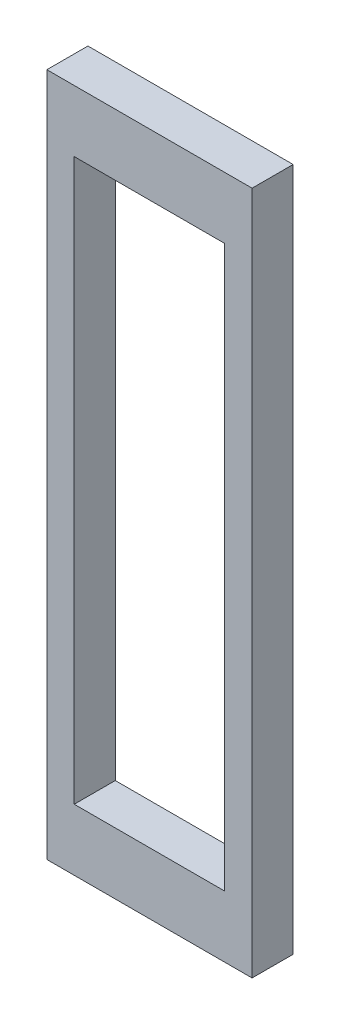
ISO-10303-21;
HEADER;
FILE_DESCRIPTION(('STEP AP214'),'2;1');
FILE_NAME('part.step','',(''),(''),'','','');
FILE_SCHEMA(('AUTOMOTIVE_DESIGN { 1 0 10303 214 1 1 1 1 }'));
ENDSEC;
DATA;
#1=APPLICATION_CONTEXT('core data for automotive mechanical design processes');
#2=APPLICATION_PROTOCOL_DEFINITION('international standard','automotive_design',2000,#1);
#3=PRODUCT_CONTEXT('',#1,'mechanical');
#4=PRODUCT('Part','Part','',(#3));
#5=PRODUCT_RELATED_PRODUCT_CATEGORY('part','',(#4));
#6=PRODUCT_DEFINITION_FORMATION('','',#4);
#7=PRODUCT_DEFINITION_CONTEXT('part definition',#1,'design');
#8=PRODUCT_DEFINITION('design','',#6,#7);
#9=PRODUCT_DEFINITION_SHAPE('','',#8);
#10=(LENGTH_UNIT() NAMED_UNIT(*) SI_UNIT(.MILLI.,.METRE.));
#11=(NAMED_UNIT(*) PLANE_ANGLE_UNIT() SI_UNIT($,.RADIAN.));
#12=(NAMED_UNIT(*) SI_UNIT($,.STERADIAN.) SOLID_ANGLE_UNIT());
#13=UNCERTAINTY_MEASURE_WITH_UNIT(LENGTH_MEASURE(1.E-05),#10,'distance_accuracy_value','');
#14=(GEOMETRIC_REPRESENTATION_CONTEXT(3) GLOBAL_UNCERTAINTY_ASSIGNED_CONTEXT((#13)) GLOBAL_UNIT_ASSIGNED_CONTEXT((#10,
#11,#12)) REPRESENTATION_CONTEXT('',''));
#15=CARTESIAN_POINT('',(0.,0.,0.));
#16=DIRECTION('',(0.,0.,1.));
#17=DIRECTION('',(1.,0.,0.));
#18=AXIS2_PLACEMENT_3D('',#15,#16,#17);
#19=CARTESIAN_POINT('',(0.,0.,-3.));
#20=DIRECTION('',(0.,0.,-1.));
#21=DIRECTION('',(-1.,0.,0.));
#22=AXIS2_PLACEMENT_3D('',#19,#20,#21);
#23=PLANE('',#22);
#24=DIRECTION('',(0.,1.,0.));
#25=VECTOR('',#24,1.);
#26=CARTESIAN_POINT('',(-7.50000000000001,25.,-3.));
#27=LINE('',#26,#25);
#28=CARTESIAN_POINT('',(-7.50000000000001,-25.,-3.));
#29=VERTEX_POINT('',#28);
#30=CARTESIAN_POINT('',(-7.50000000000001,25.,-3.));
#31=VERTEX_POINT('',#30);
#32=EDGE_CURVE('E137',#29,#31,#27,.T.);
#33=ORIENTED_EDGE('',*,*,#32,.T.);
#34=DIRECTION('',(1.,0.,0.));
#35=VECTOR('',#34,1.);
#36=CARTESIAN_POINT('',(7.50000000000001,25.,-3.));
#37=LINE('',#36,#35);
#38=CARTESIAN_POINT('',(7.50000000000001,25.,-3.));
#39=VERTEX_POINT('',#38);
#40=EDGE_CURVE('E140',#31,#39,#37,.T.);
#41=ORIENTED_EDGE('',*,*,#40,.T.);
#42=DIRECTION('',(0.,-1.,0.));
#43=VECTOR('',#42,1.);
#44=CARTESIAN_POINT('',(7.50000000000001,25.,-3.));
#45=LINE('',#44,#43);
#46=CARTESIAN_POINT('',(7.50000000000001,-25.,-3.));
#47=VERTEX_POINT('',#46);
#48=EDGE_CURVE('E143',#39,#47,#45,.T.);
#49=ORIENTED_EDGE('',*,*,#48,.T.);
#50=DIRECTION('',(-1.,0.,0.));
#51=VECTOR('',#50,1.);
#52=CARTESIAN_POINT('',(7.50000000000001,-25.,-3.));
#53=LINE('',#52,#51);
#54=EDGE_CURVE('E145',#47,#29,#53,.T.);
#55=ORIENTED_EDGE('',*,*,#54,.T.);
#56=EDGE_LOOP('',(#33,#41,#49,#55));
#57=FACE_BOUND('',#56,.T.);
#58=DIRECTION('',(-1.,0.,0.));
#59=VECTOR('',#58,1.);
#60=CARTESIAN_POINT('',(5.5,-20.5,-3.));
#61=LINE('',#60,#59);
#62=CARTESIAN_POINT('',(5.5,-20.5,-3.));
#63=VERTEX_POINT('',#62);
#64=CARTESIAN_POINT('',(-5.5,-20.5,-3.));
#65=VERTEX_POINT('',#64);
#66=EDGE_CURVE('E109',#63,#65,#61,.T.);
#67=ORIENTED_EDGE('',*,*,#66,.F.);
#68=DIRECTION('',(0.,-1.,0.));
#69=VECTOR('',#68,1.);
#70=CARTESIAN_POINT('',(5.5,20.5,-3.));
#71=LINE('',#70,#69);
#72=CARTESIAN_POINT('',(5.5,20.5,-3.));
#73=VERTEX_POINT('',#72);
#74=EDGE_CURVE('E101',#73,#63,#71,.T.);
#75=ORIENTED_EDGE('',*,*,#74,.F.);
#76=DIRECTION('',(1.,0.,0.));
#77=VECTOR('',#76,1.);
#78=CARTESIAN_POINT('',(5.5,20.5,-3.));
#79=LINE('',#78,#77);
#80=CARTESIAN_POINT('',(-5.5,20.5,-3.));
#81=VERTEX_POINT('',#80);
#82=EDGE_CURVE('E123',#81,#73,#79,.T.);
#83=ORIENTED_EDGE('',*,*,#82,.F.);
#84=DIRECTION('',(0.,1.,0.));
#85=VECTOR('',#84,1.);
#86=CARTESIAN_POINT('',(-5.5,20.5,-3.));
#87=LINE('',#86,#85);
#88=EDGE_CURVE('E121',#65,#81,#87,.T.);
#89=ORIENTED_EDGE('',*,*,#88,.F.);
#90=EDGE_LOOP('',(#67,#75,#83,#89));
#91=FACE_BOUND('',#90,.T.);
#92=ADVANCED_FACE('F36',(#57,#91),#23,.T.);
#93=CARTESIAN_POINT('',(0.,0.,0.));
#94=DIRECTION('',(0.,0.,-1.));
#95=DIRECTION('',(-1.,0.,0.));
#96=AXIS2_PLACEMENT_3D('',#93,#94,#95);
#97=PLANE('',#96);
#98=DIRECTION('',(0.,1.,0.));
#99=VECTOR('',#98,1.);
#100=CARTESIAN_POINT('',(-7.50000000000001,25.,0.));
#101=LINE('',#100,#99);
#102=CARTESIAN_POINT('',(-7.50000000000001,-25.,0.));
#103=VERTEX_POINT('',#102);
#104=CARTESIAN_POINT('',(-7.50000000000001,25.,0.));
#105=VERTEX_POINT('',#104);
#106=EDGE_CURVE('E117',#103,#105,#101,.T.);
#107=ORIENTED_EDGE('',*,*,#106,.F.);
#108=DIRECTION('',(-1.,0.,0.));
#109=VECTOR('',#108,1.);
#110=CARTESIAN_POINT('',(7.50000000000001,-25.,0.));
#111=LINE('',#110,#109);
#112=CARTESIAN_POINT('',(7.50000000000001,-25.,0.));
#113=VERTEX_POINT('',#112);
#114=EDGE_CURVE('E141',#113,#103,#111,.T.);
#115=ORIENTED_EDGE('',*,*,#114,.F.);
#116=DIRECTION('',(0.,-1.,0.));
#117=VECTOR('',#116,1.);
#118=CARTESIAN_POINT('',(7.50000000000001,25.,0.));
#119=LINE('',#118,#117);
#120=CARTESIAN_POINT('',(7.50000000000001,25.,0.));
#121=VERTEX_POINT('',#120);
#122=EDGE_CURVE('E152',#121,#113,#119,.T.);
#123=ORIENTED_EDGE('',*,*,#122,.F.);
#124=DIRECTION('',(1.,0.,0.));
#125=VECTOR('',#124,1.);
#126=CARTESIAN_POINT('',(7.50000000000001,25.,0.));
#127=LINE('',#126,#125);
#128=EDGE_CURVE('E150',#105,#121,#127,.T.);
#129=ORIENTED_EDGE('',*,*,#128,.F.);
#130=EDGE_LOOP('',(#107,#115,#123,#129));
#131=FACE_BOUND('',#130,.T.);
#132=DIRECTION('',(0.,-1.,0.));
#133=VECTOR('',#132,1.);
#134=CARTESIAN_POINT('',(5.5,20.5,0.));
#135=LINE('',#134,#133);
#136=CARTESIAN_POINT('',(5.5,20.5,0.));
#137=VERTEX_POINT('',#136);
#138=CARTESIAN_POINT('',(5.5,-20.5,0.));
#139=VERTEX_POINT('',#138);
#140=EDGE_CURVE('E59',#137,#139,#135,.T.);
#141=ORIENTED_EDGE('',*,*,#140,.T.);
#142=DIRECTION('',(-1.,0.,0.));
#143=VECTOR('',#142,1.);
#144=CARTESIAN_POINT('',(5.5,-20.5,0.));
#145=LINE('',#144,#143);
#146=CARTESIAN_POINT('',(-5.5,-20.5,0.));
#147=VERTEX_POINT('',#146);
#148=EDGE_CURVE('E116',#139,#147,#145,.T.);
#149=ORIENTED_EDGE('',*,*,#148,.T.);
#150=DIRECTION('',(0.,1.,0.));
#151=VECTOR('',#150,1.);
#152=CARTESIAN_POINT('',(-5.5,20.5,0.));
#153=LINE('',#152,#151);
#154=CARTESIAN_POINT('',(-5.5,20.5,0.));
#155=VERTEX_POINT('',#154);
#156=EDGE_CURVE('E129',#147,#155,#153,.T.);
#157=ORIENTED_EDGE('',*,*,#156,.T.);
#158=DIRECTION('',(1.,0.,0.));
#159=VECTOR('',#158,1.);
#160=CARTESIAN_POINT('',(5.5,20.5,0.));
#161=LINE('',#160,#159);
#162=EDGE_CURVE('E110',#155,#137,#161,.T.);
#163=ORIENTED_EDGE('',*,*,#162,.T.);
#164=EDGE_LOOP('',(#141,#149,#157,#163));
#165=FACE_BOUND('',#164,.T.);
#166=ADVANCED_FACE('F170',(#131,#165),#97,.F.);
#167=CARTESIAN_POINT('',(-7.50000000000001,25.,-3.));
#168=DIRECTION('',(1.,0.,0.));
#169=DIRECTION('',(0.,0.,-1.));
#170=AXIS2_PLACEMENT_3D('',#167,#168,#169);
#171=PLANE('',#170);
#172=ORIENTED_EDGE('',*,*,#106,.T.);
#173=DIRECTION('',(0.,0.,1.));
#174=VECTOR('',#173,1.);
#175=CARTESIAN_POINT('',(-7.50000000000001,25.,-3.));
#176=LINE('',#175,#174);
#177=EDGE_CURVE('E11',#31,#105,#176,.T.);
#178=ORIENTED_EDGE('',*,*,#177,.F.);
#179=ORIENTED_EDGE('',*,*,#32,.F.);
#180=DIRECTION('',(0.,0.,1.));
#181=VECTOR('',#180,1.);
#182=CARTESIAN_POINT('',(-7.50000000000001,-25.,-3.));
#183=LINE('',#182,#181);
#184=EDGE_CURVE('E147',#29,#103,#183,.T.);
#185=ORIENTED_EDGE('',*,*,#184,.T.);
#186=EDGE_LOOP('',(#172,#178,#179,#185));
#187=FACE_BOUND('',#186,.T.);
#188=ADVANCED_FACE('F38',(#187),#171,.F.);
#189=CARTESIAN_POINT('',(7.50000000000001,25.,-3.));
#190=DIRECTION('',(0.,-1.,0.));
#191=DIRECTION('',(0.,0.,-1.));
#192=AXIS2_PLACEMENT_3D('',#189,#190,#191);
#193=PLANE('',#192);
#194=ORIENTED_EDGE('',*,*,#128,.T.);
#195=DIRECTION('',(0.,0.,1.));
#196=VECTOR('',#195,1.);
#197=CARTESIAN_POINT('',(7.50000000000001,25.,-3.));
#198=LINE('',#197,#196);
#199=EDGE_CURVE('E44',#39,#121,#198,.T.);
#200=ORIENTED_EDGE('',*,*,#199,.F.);
#201=ORIENTED_EDGE('',*,*,#40,.F.);
#202=ORIENTED_EDGE('',*,*,#177,.T.);
#203=EDGE_LOOP('',(#194,#200,#201,#202));
#204=FACE_BOUND('',#203,.T.);
#205=ADVANCED_FACE('F180',(#204),#193,.F.);
#206=CARTESIAN_POINT('',(7.50000000000001,25.,-3.));
#207=DIRECTION('',(-1.,0.,0.));
#208=DIRECTION('',(0.,0.,1.));
#209=AXIS2_PLACEMENT_3D('',#206,#207,#208);
#210=PLANE('',#209);
#211=ORIENTED_EDGE('',*,*,#122,.T.);
#212=DIRECTION('',(0.,0.,1.));
#213=VECTOR('',#212,1.);
#214=CARTESIAN_POINT('',(7.50000000000001,-25.,-3.));
#215=LINE('',#214,#213);
#216=EDGE_CURVE('E157',#47,#113,#215,.T.);
#217=ORIENTED_EDGE('',*,*,#216,.F.);
#218=ORIENTED_EDGE('',*,*,#48,.F.);
#219=ORIENTED_EDGE('',*,*,#199,.T.);
#220=EDGE_LOOP('',(#211,#217,#218,#219));
#221=FACE_BOUND('',#220,.T.);
#222=ADVANCED_FACE('F164',(#221),#210,.F.);
#223=CARTESIAN_POINT('',(7.50000000000001,-25.,-3.));
#224=DIRECTION('',(0.,1.,0.));
#225=DIRECTION('',(0.,0.,1.));
#226=AXIS2_PLACEMENT_3D('',#223,#224,#225);
#227=PLANE('',#226);
#228=ORIENTED_EDGE('',*,*,#114,.T.);
#229=ORIENTED_EDGE('',*,*,#184,.F.);
#230=ORIENTED_EDGE('',*,*,#54,.F.);
#231=ORIENTED_EDGE('',*,*,#216,.T.);
#232=EDGE_LOOP('',(#228,#229,#230,#231));
#233=FACE_BOUND('',#232,.T.);
#234=ADVANCED_FACE('F174',(#233),#227,.F.);
#235=CARTESIAN_POINT('',(5.5,20.5,-3.));
#236=DIRECTION('',(-1.,0.,0.));
#237=DIRECTION('',(0.,0.,1.));
#238=AXIS2_PLACEMENT_3D('',#235,#236,#237);
#239=PLANE('',#238);
#240=ORIENTED_EDGE('',*,*,#140,.F.);
#241=DIRECTION('',(0.,0.,1.));
#242=VECTOR('',#241,1.);
#243=CARTESIAN_POINT('',(5.5,20.5,-3.));
#244=LINE('',#243,#242);
#245=EDGE_CURVE('E105',#73,#137,#244,.T.);
#246=ORIENTED_EDGE('',*,*,#245,.F.);
#247=ORIENTED_EDGE('',*,*,#74,.T.);
#248=DIRECTION('',(0.,0.,1.));
#249=VECTOR('',#248,1.);
#250=CARTESIAN_POINT('',(5.5,-20.5,-3.));
#251=LINE('',#250,#249);
#252=EDGE_CURVE('E104',#63,#139,#251,.T.);
#253=ORIENTED_EDGE('',*,*,#252,.T.);
#254=EDGE_LOOP('',(#240,#246,#247,#253));
#255=FACE_BOUND('',#254,.T.);
#256=ADVANCED_FACE('F103',(#255),#239,.T.);
#257=CARTESIAN_POINT('',(5.5,-20.5,-3.));
#258=DIRECTION('',(0.,1.,0.));
#259=DIRECTION('',(0.,0.,1.));
#260=AXIS2_PLACEMENT_3D('',#257,#258,#259);
#261=PLANE('',#260);
#262=ORIENTED_EDGE('',*,*,#148,.F.);
#263=ORIENTED_EDGE('',*,*,#252,.F.);
#264=ORIENTED_EDGE('',*,*,#66,.T.);
#265=DIRECTION('',(0.,0.,1.));
#266=VECTOR('',#265,1.);
#267=CARTESIAN_POINT('',(-5.5,-20.5,-3.));
#268=LINE('',#267,#266);
#269=EDGE_CURVE('E118',#65,#147,#268,.T.);
#270=ORIENTED_EDGE('',*,*,#269,.T.);
#271=EDGE_LOOP('',(#262,#263,#264,#270));
#272=FACE_BOUND('',#271,.T.);
#273=ADVANCED_FACE('F113',(#272),#261,.T.);
#274=CARTESIAN_POINT('',(-5.5,20.5,-3.));
#275=DIRECTION('',(1.,0.,0.));
#276=DIRECTION('',(0.,0.,-1.));
#277=AXIS2_PLACEMENT_3D('',#274,#275,#276);
#278=PLANE('',#277);
#279=ORIENTED_EDGE('',*,*,#156,.F.);
#280=ORIENTED_EDGE('',*,*,#269,.F.);
#281=ORIENTED_EDGE('',*,*,#88,.T.);
#282=DIRECTION('',(0.,0.,1.));
#283=VECTOR('',#282,1.);
#284=CARTESIAN_POINT('',(-5.5,20.5,-3.));
#285=LINE('',#284,#283);
#286=EDGE_CURVE('E51',#81,#155,#285,.T.);
#287=ORIENTED_EDGE('',*,*,#286,.T.);
#288=EDGE_LOOP('',(#279,#280,#281,#287));
#289=FACE_BOUND('',#288,.T.);
#290=ADVANCED_FACE('F203',(#289),#278,.T.);
#291=CARTESIAN_POINT('',(5.5,20.5,-3.));
#292=DIRECTION('',(0.,-1.,0.));
#293=DIRECTION('',(0.,0.,-1.));
#294=AXIS2_PLACEMENT_3D('',#291,#292,#293);
#295=PLANE('',#294);
#296=ORIENTED_EDGE('',*,*,#162,.F.);
#297=ORIENTED_EDGE('',*,*,#286,.F.);
#298=ORIENTED_EDGE('',*,*,#82,.T.);
#299=ORIENTED_EDGE('',*,*,#245,.T.);
#300=EDGE_LOOP('',(#296,#297,#298,#299));
#301=FACE_BOUND('',#300,.T.);
#302=ADVANCED_FACE('F207',(#301),#295,.T.);
#303=CLOSED_SHELL('',(#92,#166,#188,#205,#222,#234,#256,#273,#290,#302));
#304=MANIFOLD_SOLID_BREP('B2',#303);
#305=ADVANCED_BREP_SHAPE_REPRESENTATION('',(#18,#304),#14);
#306=SHAPE_DEFINITION_REPRESENTATION(#9,#305);
ENDSEC;
END-ISO-10303-21;
